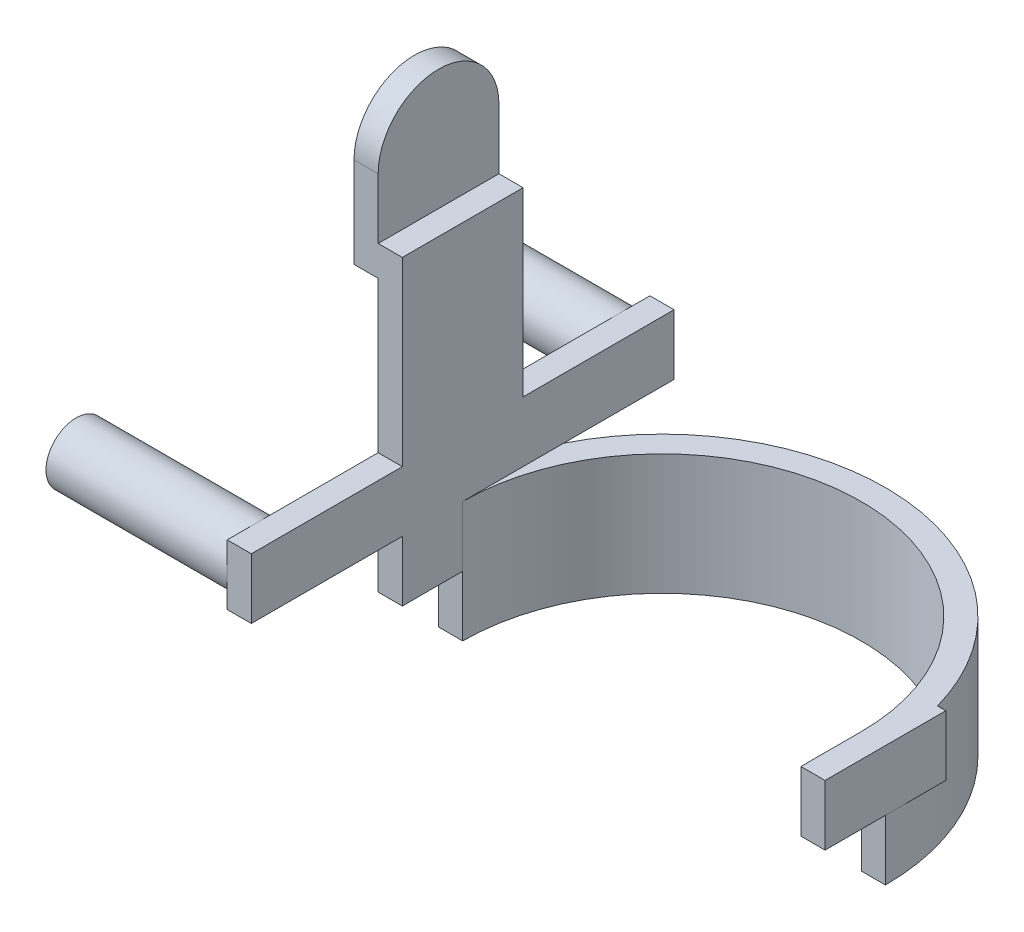
ISO-10303-21;
HEADER;
FILE_DESCRIPTION(('STEP AP214'),'2;1');
FILE_NAME('part.step','',(''),(''),'','','');
FILE_SCHEMA(('AUTOMOTIVE_DESIGN { 1 0 10303 214 1 1 1 1 }'));
ENDSEC;
DATA;
#1=APPLICATION_CONTEXT('core data for automotive mechanical design processes');
#2=APPLICATION_PROTOCOL_DEFINITION('international standard','automotive_design',2000,#1);
#3=PRODUCT_CONTEXT('',#1,'mechanical');
#4=PRODUCT('Part','Part','',(#3));
#5=PRODUCT_RELATED_PRODUCT_CATEGORY('part','',(#4));
#6=PRODUCT_DEFINITION_FORMATION('','',#4);
#7=PRODUCT_DEFINITION_CONTEXT('part definition',#1,'design');
#8=PRODUCT_DEFINITION('design','',#6,#7);
#9=PRODUCT_DEFINITION_SHAPE('','',#8);
#10=(LENGTH_UNIT() NAMED_UNIT(*) SI_UNIT(.MILLI.,.METRE.));
#11=(NAMED_UNIT(*) PLANE_ANGLE_UNIT() SI_UNIT($,.RADIAN.));
#12=(NAMED_UNIT(*) SI_UNIT($,.STERADIAN.) SOLID_ANGLE_UNIT());
#13=UNCERTAINTY_MEASURE_WITH_UNIT(LENGTH_MEASURE(1.E-05),#10,'distance_accuracy_value','');
#14=(GEOMETRIC_REPRESENTATION_CONTEXT(3) GLOBAL_UNCERTAINTY_ASSIGNED_CONTEXT((#13)) GLOBAL_UNIT_ASSIGNED_CONTEXT((#10,
#11,#12)) REPRESENTATION_CONTEXT('',''));
#15=CARTESIAN_POINT('',(0.,0.,0.));
#16=DIRECTION('',(0.,0.,1.));
#17=DIRECTION('',(1.,0.,0.));
#18=AXIS2_PLACEMENT_3D('',#15,#16,#17);
#19=CARTESIAN_POINT('',(-74.,40.,20.));
#20=DIRECTION('',(0.,0.,-1.));
#21=DIRECTION('',(-1.,0.,0.));
#22=AXIS2_PLACEMENT_3D('',#19,#20,#21);
#23=PLANE('',#22);
#24=DIRECTION('',(-1.,0.,0.));
#25=VECTOR('',#24,1.);
#26=CARTESIAN_POINT('',(-42.,140.,20.));
#27=LINE('',#26,#25);
#28=CARTESIAN_POINT('',(-74.,140.,20.));
#29=VERTEX_POINT('',#28);
#30=CARTESIAN_POINT('',(-82.,140.,20.));
#31=VERTEX_POINT('',#30);
#32=EDGE_CURVE('E226',#29,#31,#27,.T.);
#33=ORIENTED_EDGE('',*,*,#32,.T.);
#34=DIRECTION('',(0.,-1.,0.));
#35=VECTOR('',#34,1.);
#36=CARTESIAN_POINT('',(-82.,110.,20.));
#37=LINE('',#36,#35);
#38=CARTESIAN_POINT('',(-82.,110.,20.));
#39=VERTEX_POINT('',#38);
#40=EDGE_CURVE('E237',#31,#39,#37,.T.);
#41=ORIENTED_EDGE('',*,*,#40,.T.);
#42=DIRECTION('',(1.,0.,0.));
#43=VECTOR('',#42,1.);
#44=CARTESIAN_POINT('',(-74.,110.,20.));
#45=LINE('',#44,#43);
#46=CARTESIAN_POINT('',(-74.,110.,20.));
#47=VERTEX_POINT('',#46);
#48=EDGE_CURVE('E246',#39,#47,#45,.T.);
#49=ORIENTED_EDGE('',*,*,#48,.T.);
#50=DIRECTION('',(0.,-1.,0.));
#51=VECTOR('',#50,1.);
#52=CARTESIAN_POINT('',(-74.,40.,20.));
#53=LINE('',#52,#51);
#54=CARTESIAN_POINT('',(-74.,60.,20.));
#55=VERTEX_POINT('',#54);
#56=EDGE_CURVE('E417',#47,#55,#53,.T.);
#57=ORIENTED_EDGE('',*,*,#56,.T.);
#58=DIRECTION('',(1.,0.,0.));
#59=VECTOR('',#58,1.);
#60=CARTESIAN_POINT('',(-74.,60.,20.));
#61=LINE('',#60,#59);
#62=CARTESIAN_POINT('',(-66.,60.,20.));
#63=VERTEX_POINT('',#62);
#64=EDGE_CURVE('E319',#55,#63,#61,.T.);
#65=ORIENTED_EDGE('',*,*,#64,.T.);
#66=DIRECTION('',(0.,-1.,0.));
#67=VECTOR('',#66,1.);
#68=CARTESIAN_POINT('',(-66.,40.,20.));
#69=LINE('',#68,#67);
#70=CARTESIAN_POINT('',(-66.,120.,20.));
#71=VERTEX_POINT('',#70);
#72=EDGE_CURVE('E413',#71,#63,#69,.T.);
#73=ORIENTED_EDGE('',*,*,#72,.F.);
#74=DIRECTION('',(1.,0.,0.));
#75=VECTOR('',#74,1.);
#76=CARTESIAN_POINT('',(-74.,120.,20.));
#77=LINE('',#76,#75);
#78=CARTESIAN_POINT('',(-74.,120.,20.));
#79=VERTEX_POINT('',#78);
#80=EDGE_CURVE('E388',#79,#71,#77,.T.);
#81=ORIENTED_EDGE('',*,*,#80,.F.);
#82=DIRECTION('',(0.,1.,0.));
#83=VECTOR('',#82,1.);
#84=CARTESIAN_POINT('',(-74.,110.,20.));
#85=LINE('',#84,#83);
#86=EDGE_CURVE('E240',#79,#29,#85,.T.);
#87=ORIENTED_EDGE('',*,*,#86,.T.);
#88=EDGE_LOOP('',(#33,#41,#49,#57,#65,#73,#81,#87));
#89=FACE_BOUND('',#88,.T.);
#90=ADVANCED_FACE('F34',(#89),#23,.F.);
#91=CARTESIAN_POINT('',(-74.,40.,-20.));
#92=DIRECTION('',(1.,0.,0.));
#93=DIRECTION('',(0.,0.,-1.));
#94=AXIS2_PLACEMENT_3D('',#91,#92,#93);
#95=PLANE('',#94);
#96=CARTESIAN_POINT('',(-74.,50.,60.));
#97=DIRECTION('',(-1.,0.,0.));
#98=DIRECTION('',(0.,0.,1.));
#99=AXIS2_PLACEMENT_3D('',#96,#97,#98);
#100=CIRCLE('',#99,9.99999999999999);
#101=CARTESIAN_POINT('',(-74.,40.,60.));
#102=VERTEX_POINT('',#101);
#103=CARTESIAN_POINT('',(-74.,50.,70.));
#104=VERTEX_POINT('',#103);
#105=EDGE_CURVE('E256',#102,#104,#100,.T.);
#106=ORIENTED_EDGE('',*,*,#105,.F.);
#107=DIRECTION('',(0.,0.,1.));
#108=VECTOR('',#107,1.);
#109=CARTESIAN_POINT('',(-74.,40.,-70.));
#110=LINE('',#109,#108);
#111=CARTESIAN_POINT('',(-74.,40.,70.));
#112=VERTEX_POINT('',#111);
#113=EDGE_CURVE('E290',#102,#112,#110,.T.);
#114=ORIENTED_EDGE('',*,*,#113,.T.);
#115=DIRECTION('',(0.,1.,0.));
#116=VECTOR('',#115,1.);
#117=CARTESIAN_POINT('',(-74.,60.,70.));
#118=LINE('',#117,#116);
#119=EDGE_CURVE('E297',#112,#104,#118,.T.);
#120=ORIENTED_EDGE('',*,*,#119,.T.);
#121=EDGE_LOOP('',(#106,#114,#120));
#122=FACE_BOUND('',#121,.T.);
#123=ADVANCED_FACE('F542',(#122),#95,.F.);
#124=CARTESIAN_POINT('',(-74.,60.,60.));
#125=VERTEX_POINT('',#124);
#126=EDGE_CURVE('E58',#104,#125,#100,.T.);
#127=ORIENTED_EDGE('',*,*,#126,.F.);
#128=CARTESIAN_POINT('',(-74.,60.,70.));
#129=VERTEX_POINT('',#128);
#130=EDGE_CURVE('E294',#104,#129,#118,.T.);
#131=ORIENTED_EDGE('',*,*,#130,.T.);
#132=DIRECTION('',(0.,0.,-1.));
#133=VECTOR('',#132,1.);
#134=CARTESIAN_POINT('',(-74.,60.,-70.));
#135=LINE('',#134,#133);
#136=EDGE_CURVE('E276',#129,#125,#135,.T.);
#137=ORIENTED_EDGE('',*,*,#136,.T.);
#138=EDGE_LOOP('',(#127,#131,#137));
#139=FACE_BOUND('',#138,.T.);
#140=ADVANCED_FACE('F547',(#139),#95,.F.);
#141=CARTESIAN_POINT('',(-74.,50.,-60.));
#142=DIRECTION('',(-1.,0.,0.));
#143=DIRECTION('',(0.,0.,1.));
#144=AXIS2_PLACEMENT_3D('',#141,#142,#143);
#145=CIRCLE('',#144,10.);
#146=CARTESIAN_POINT('',(-74.,50.,-70.));
#147=VERTEX_POINT('',#146);
#148=CARTESIAN_POINT('',(-74.,40.,-60.));
#149=VERTEX_POINT('',#148);
#150=EDGE_CURVE('E271',#147,#149,#145,.T.);
#151=ORIENTED_EDGE('',*,*,#150,.F.);
#152=DIRECTION('',(0.,-1.,0.));
#153=VECTOR('',#152,1.);
#154=CARTESIAN_POINT('',(-74.,60.,-70.));
#155=LINE('',#154,#153);
#156=CARTESIAN_POINT('',(-74.,40.,-70.));
#157=VERTEX_POINT('',#156);
#158=EDGE_CURVE('E267',#147,#157,#155,.T.);
#159=ORIENTED_EDGE('',*,*,#158,.T.);
#160=EDGE_CURVE('E291',#157,#149,#110,.T.);
#161=ORIENTED_EDGE('',*,*,#160,.T.);
#162=EDGE_LOOP('',(#151,#159,#161));
#163=FACE_BOUND('',#162,.T.);
#164=ADVANCED_FACE('F564',(#163),#95,.F.);
#165=ORIENTED_EDGE('',*,*,#56,.F.);
#166=DIRECTION('',(0.,0.,1.));
#167=VECTOR('',#166,1.);
#168=CARTESIAN_POINT('',(-74.,110.,-20.));
#169=LINE('',#168,#167);
#170=CARTESIAN_POINT('',(-74.,110.,-20.));
#171=VERTEX_POINT('',#170);
#172=EDGE_CURVE('E254',#171,#47,#169,.T.);
#173=ORIENTED_EDGE('',*,*,#172,.F.);
#174=DIRECTION('',(0.,-1.,0.));
#175=VECTOR('',#174,1.);
#176=CARTESIAN_POINT('',(-74.,40.,-20.));
#177=LINE('',#176,#175);
#178=CARTESIAN_POINT('',(-74.,60.,-20.));
#179=VERTEX_POINT('',#178);
#180=EDGE_CURVE('E420',#171,#179,#177,.T.);
#181=ORIENTED_EDGE('',*,*,#180,.T.);
#182=CARTESIAN_POINT('',(-74.,60.,-60.));
#183=VERTEX_POINT('',#182);
#184=EDGE_CURVE('E303',#179,#183,#135,.T.);
#185=ORIENTED_EDGE('',*,*,#184,.T.);
#186=EDGE_CURVE('E262',#149,#183,#145,.T.);
#187=ORIENTED_EDGE('',*,*,#186,.F.);
#188=CARTESIAN_POINT('',(-74.,40.,-20.));
#189=VERTEX_POINT('',#188);
#190=EDGE_CURVE('E295',#149,#189,#110,.T.);
#191=ORIENTED_EDGE('',*,*,#190,.T.);
#192=CARTESIAN_POINT('',(-74.,20.,-20.));
#193=VERTEX_POINT('',#192);
#194=EDGE_CURVE('E419',#189,#193,#177,.T.);
#195=ORIENTED_EDGE('',*,*,#194,.T.);
#196=DIRECTION('',(0.,0.,-1.));
#197=VECTOR('',#196,1.);
#198=CARTESIAN_POINT('',(-74.,20.,-20.));
#199=LINE('',#198,#197);
#200=CARTESIAN_POINT('',(-74.,20.,0.));
#201=VERTEX_POINT('',#200);
#202=EDGE_CURVE('E366',#201,#193,#199,.T.);
#203=ORIENTED_EDGE('',*,*,#202,.F.);
#204=CARTESIAN_POINT('',(-74.,20.,20.));
#205=VERTEX_POINT('',#204);
#206=EDGE_CURVE('E356',#205,#201,#199,.T.);
#207=ORIENTED_EDGE('',*,*,#206,.F.);
#208=CARTESIAN_POINT('',(-74.,40.,20.));
#209=VERTEX_POINT('',#208);
#210=EDGE_CURVE('E416',#209,#205,#53,.T.);
#211=ORIENTED_EDGE('',*,*,#210,.F.);
#212=EDGE_CURVE('E296',#209,#102,#110,.T.);
#213=ORIENTED_EDGE('',*,*,#212,.T.);
#214=EDGE_CURVE('E50',#125,#102,#100,.T.);
#215=ORIENTED_EDGE('',*,*,#214,.F.);
#216=EDGE_CURVE('E302',#125,#55,#135,.T.);
#217=ORIENTED_EDGE('',*,*,#216,.T.);
#218=EDGE_LOOP('',(#165,#173,#181,#185,#187,#191,#195,#203,#207,#211,#213,#215,#217));
#219=FACE_BOUND('',#218,.T.);
#220=ADVANCED_FACE('F466',(#219),#95,.F.);
#221=CARTESIAN_POINT('',(-74.,40.,-20.));
#222=DIRECTION('',(0.,0.,1.));
#223=DIRECTION('',(1.,0.,0.));
#224=AXIS2_PLACEMENT_3D('',#221,#222,#223);
#225=PLANE('',#224);
#226=DIRECTION('',(0.,-1.,0.));
#227=VECTOR('',#226,1.);
#228=CARTESIAN_POINT('',(-82.,110.,-20.));
#229=LINE('',#228,#227);
#230=CARTESIAN_POINT('',(-82.,140.,-20.));
#231=VERTEX_POINT('',#230);
#232=CARTESIAN_POINT('',(-82.,110.,-20.));
#233=VERTEX_POINT('',#232);
#234=EDGE_CURVE('E586',#231,#233,#229,.T.);
#235=ORIENTED_EDGE('',*,*,#234,.F.);
#236=DIRECTION('',(-1.,0.,0.));
#237=VECTOR('',#236,1.);
#238=CARTESIAN_POINT('',(-42.,140.,-20.));
#239=LINE('',#238,#237);
#240=CARTESIAN_POINT('',(-74.,140.,-20.));
#241=VERTEX_POINT('',#240);
#242=EDGE_CURVE('E229',#241,#231,#239,.T.);
#243=ORIENTED_EDGE('',*,*,#242,.F.);
#244=DIRECTION('',(0.,1.,0.));
#245=VECTOR('',#244,1.);
#246=CARTESIAN_POINT('',(-74.,110.,-20.));
#247=LINE('',#246,#245);
#248=CARTESIAN_POINT('',(-74.,120.,-20.));
#249=VERTEX_POINT('',#248);
#250=EDGE_CURVE('E248',#249,#241,#247,.T.);
#251=ORIENTED_EDGE('',*,*,#250,.F.);
#252=DIRECTION('',(-1.,0.,0.));
#253=VECTOR('',#252,1.);
#254=CARTESIAN_POINT('',(-74.,120.,-20.));
#255=LINE('',#254,#253);
#256=CARTESIAN_POINT('',(-66.,120.,-20.));
#257=VERTEX_POINT('',#256);
#258=EDGE_CURVE('E393',#257,#249,#255,.T.);
#259=ORIENTED_EDGE('',*,*,#258,.F.);
#260=DIRECTION('',(0.,-1.,0.));
#261=VECTOR('',#260,1.);
#262=CARTESIAN_POINT('',(-66.,120.,-20.));
#263=LINE('',#262,#261);
#264=CARTESIAN_POINT('',(-66.,60.,-20.));
#265=VERTEX_POINT('',#264);
#266=EDGE_CURVE('E395',#257,#265,#263,.T.);
#267=ORIENTED_EDGE('',*,*,#266,.T.);
#268=DIRECTION('',(-1.,0.,0.));
#269=VECTOR('',#268,1.);
#270=CARTESIAN_POINT('',(-74.,60.,-20.));
#271=LINE('',#270,#269);
#272=EDGE_CURVE('E323',#265,#179,#271,.T.);
#273=ORIENTED_EDGE('',*,*,#272,.T.);
#274=ORIENTED_EDGE('',*,*,#180,.F.);
#275=DIRECTION('',(1.,0.,0.));
#276=VECTOR('',#275,1.);
#277=CARTESIAN_POINT('',(-74.,110.,-20.));
#278=LINE('',#277,#276);
#279=EDGE_CURVE('E258',#233,#171,#278,.T.);
#280=ORIENTED_EDGE('',*,*,#279,.F.);
#281=EDGE_LOOP('',(#235,#243,#251,#259,#267,#273,#274,#280));
#282=FACE_BOUND('',#281,.T.);
#283=ADVANCED_FACE('F505',(#282),#225,.F.);
#284=CARTESIAN_POINT('',(0.,40.,0.));
#285=DIRECTION('',(0.,1.,0.));
#286=DIRECTION('',(0.,0.,1.));
#287=AXIS2_PLACEMENT_3D('',#284,#285,#286);
#288=PLANE('',#287);
#289=CARTESIAN_POINT('',(0.,40.,0.));
#290=DIRECTION('',(0.,1.,0.));
#291=DIRECTION('',(0.,0.,1.));
#292=AXIS2_PLACEMENT_3D('',#289,#290,#291);
#293=CIRCLE('',#292,74.);
#294=CARTESIAN_POINT('',(71.2460525222275,40.,-20.));
#295=VERTEX_POINT('',#294);
#296=CARTESIAN_POINT('',(-66.,40.,-33.466401061363));
#297=VERTEX_POINT('',#296);
#298=EDGE_CURVE('E403',#295,#297,#293,.T.);
#299=ORIENTED_EDGE('',*,*,#298,.T.);
#300=DIRECTION('',(0.,0.,-1.));
#301=VECTOR('',#300,1.);
#302=CARTESIAN_POINT('',(-66.,40.,20.));
#303=LINE('',#302,#301);
#304=CARTESIAN_POINT('',(-66.,40.,0.));
#305=VERTEX_POINT('',#304);
#306=EDGE_CURVE('E11',#305,#297,#303,.T.);
#307=ORIENTED_EDGE('',*,*,#306,.F.);
#308=CARTESIAN_POINT('',(0.,40.,0.));
#309=DIRECTION('',(0.,-1.,0.));
#310=DIRECTION('',(0.,0.,1.));
#311=AXIS2_PLACEMENT_3D('',#308,#309,#310);
#312=CIRCLE('',#311,66.);
#313=CARTESIAN_POINT('',(66.,40.,0.));
#314=VERTEX_POINT('',#313);
#315=EDGE_CURVE('E399',#305,#314,#312,.T.);
#316=ORIENTED_EDGE('',*,*,#315,.T.);
#317=DIRECTION('',(0.,0.,-1.));
#318=VECTOR('',#317,1.);
#319=CARTESIAN_POINT('',(66.,40.,0.));
#320=LINE('',#319,#318);
#321=CARTESIAN_POINT('',(66.,40.,20.));
#322=VERTEX_POINT('',#321);
#323=EDGE_CURVE('E382',#322,#314,#320,.T.);
#324=ORIENTED_EDGE('',*,*,#323,.F.);
#325=DIRECTION('',(-1.,0.,0.));
#326=VECTOR('',#325,1.);
#327=CARTESIAN_POINT('',(74.,40.,20.));
#328=LINE('',#327,#326);
#329=CARTESIAN_POINT('',(74.,40.,20.));
#330=VERTEX_POINT('',#329);
#331=EDGE_CURVE('E379',#330,#322,#328,.T.);
#332=ORIENTED_EDGE('',*,*,#331,.F.);
#333=DIRECTION('',(0.,0.,-1.));
#334=VECTOR('',#333,1.);
#335=CARTESIAN_POINT('',(74.,40.,-20.));
#336=LINE('',#335,#334);
#337=CARTESIAN_POINT('',(74.,40.,-20.));
#338=VERTEX_POINT('',#337);
#339=EDGE_CURVE('E374',#330,#338,#336,.T.);
#340=ORIENTED_EDGE('',*,*,#339,.T.);
#341=DIRECTION('',(1.,0.,0.));
#342=VECTOR('',#341,1.);
#343=CARTESIAN_POINT('',(64.,40.,-20.));
#344=LINE('',#343,#342);
#345=EDGE_CURVE('E376',#295,#338,#344,.T.);
#346=ORIENTED_EDGE('',*,*,#345,.F.);
#347=EDGE_LOOP('',(#299,#307,#316,#324,#332,#340,#346));
#348=FACE_BOUND('',#347,.T.);
#349=ADVANCED_FACE('F480',(#348),#288,.T.);
#350=CARTESIAN_POINT('',(66.,40.,0.));
#351=DIRECTION('',(1.,0.,0.));
#352=DIRECTION('',(0.,0.,-1.));
#353=AXIS2_PLACEMENT_3D('',#350,#351,#352);
#354=PLANE('',#353);
#355=DIRECTION('',(0.,0.,1.));
#356=VECTOR('',#355,1.);
#357=CARTESIAN_POINT('',(66.,20.,20.));
#358=LINE('',#357,#356);
#359=CARTESIAN_POINT('',(66.,20.,0.));
#360=VERTEX_POINT('',#359);
#361=CARTESIAN_POINT('',(66.,20.,20.));
#362=VERTEX_POINT('',#361);
#363=EDGE_CURVE('E344',#360,#362,#358,.T.);
#364=ORIENTED_EDGE('',*,*,#363,.T.);
#365=DIRECTION('',(0.,-1.,0.));
#366=VECTOR('',#365,1.);
#367=CARTESIAN_POINT('',(66.,40.,20.));
#368=LINE('',#367,#366);
#369=EDGE_CURVE('E433',#322,#362,#368,.T.);
#370=ORIENTED_EDGE('',*,*,#369,.F.);
#371=ORIENTED_EDGE('',*,*,#323,.T.);
#372=DIRECTION('',(0.,-1.,0.));
#373=VECTOR('',#372,1.);
#374=CARTESIAN_POINT('',(66.,40.,0.));
#375=LINE('',#374,#373);
#376=EDGE_CURVE('E38',#314,#360,#375,.T.);
#377=ORIENTED_EDGE('',*,*,#376,.T.);
#378=EDGE_LOOP('',(#364,#370,#371,#377));
#379=FACE_BOUND('',#378,.T.);
#380=ADVANCED_FACE('F440',(#379),#354,.F.);
#381=CARTESIAN_POINT('',(74.,40.,20.));
#382=DIRECTION('',(0.,0.,-1.));
#383=DIRECTION('',(-1.,0.,0.));
#384=AXIS2_PLACEMENT_3D('',#381,#382,#383);
#385=PLANE('',#384);
#386=DIRECTION('',(1.,0.,0.));
#387=VECTOR('',#386,1.);
#388=CARTESIAN_POINT('',(71.2460525222275,20.,20.));
#389=LINE('',#388,#387);
#390=CARTESIAN_POINT('',(74.,20.,20.));
#391=VERTEX_POINT('',#390);
#392=EDGE_CURVE('E347',#362,#391,#389,.T.);
#393=ORIENTED_EDGE('',*,*,#392,.T.);
#394=DIRECTION('',(0.,-1.,0.));
#395=VECTOR('',#394,1.);
#396=CARTESIAN_POINT('',(74.,40.,20.));
#397=LINE('',#396,#395);
#398=EDGE_CURVE('E431',#330,#391,#397,.T.);
#399=ORIENTED_EDGE('',*,*,#398,.F.);
#400=ORIENTED_EDGE('',*,*,#331,.T.);
#401=ORIENTED_EDGE('',*,*,#369,.T.);
#402=EDGE_LOOP('',(#393,#399,#400,#401));
#403=FACE_BOUND('',#402,.T.);
#404=ADVANCED_FACE('F641',(#403),#385,.F.);
#405=CARTESIAN_POINT('',(74.,40.,-20.));
#406=DIRECTION('',(-1.,0.,0.));
#407=DIRECTION('',(0.,0.,1.));
#408=AXIS2_PLACEMENT_3D('',#405,#406,#407);
#409=PLANE('',#408);
#410=DIRECTION('',(0.,0.,1.));
#411=VECTOR('',#410,1.);
#412=CARTESIAN_POINT('',(74.,20.,-20.));
#413=LINE('',#412,#411);
#414=CARTESIAN_POINT('',(74.,20.,-20.));
#415=VERTEX_POINT('',#414);
#416=CARTESIAN_POINT('',(74.,20.,0.));
#417=VERTEX_POINT('',#416);
#418=EDGE_CURVE('E371',#415,#417,#413,.T.);
#419=ORIENTED_EDGE('',*,*,#418,.F.);
#420=DIRECTION('',(0.,-1.,0.));
#421=VECTOR('',#420,1.);
#422=CARTESIAN_POINT('',(74.,40.,-20.));
#423=LINE('',#422,#421);
#424=EDGE_CURVE('E428',#338,#415,#423,.T.);
#425=ORIENTED_EDGE('',*,*,#424,.F.);
#426=ORIENTED_EDGE('',*,*,#339,.F.);
#427=ORIENTED_EDGE('',*,*,#398,.T.);
#428=EDGE_CURVE('E373',#417,#391,#413,.T.);
#429=ORIENTED_EDGE('',*,*,#428,.F.);
#430=EDGE_LOOP('',(#419,#425,#426,#427,#429));
#431=FACE_BOUND('',#430,.T.);
#432=ADVANCED_FACE('F638',(#431),#409,.F.);
#433=CARTESIAN_POINT('',(74.,40.,-20.));
#434=DIRECTION('',(0.,0.,1.));
#435=DIRECTION('',(1.,0.,0.));
#436=AXIS2_PLACEMENT_3D('',#433,#434,#435);
#437=PLANE('',#436);
#438=DIRECTION('',(1.,0.,0.));
#439=VECTOR('',#438,1.);
#440=CARTESIAN_POINT('',(74.,20.,-20.));
#441=LINE('',#440,#439);
#442=CARTESIAN_POINT('',(71.2460525222275,20.,-20.));
#443=VERTEX_POINT('',#442);
#444=EDGE_CURVE('E369',#443,#415,#441,.T.);
#445=ORIENTED_EDGE('',*,*,#444,.F.);
#446=DIRECTION('',(0.,-1.,0.));
#447=VECTOR('',#446,1.);
#448=CARTESIAN_POINT('',(71.2460525222275,40.,-20.));
#449=LINE('',#448,#447);
#450=EDGE_CURVE('E425',#295,#443,#449,.T.);
#451=ORIENTED_EDGE('',*,*,#450,.F.);
#452=ORIENTED_EDGE('',*,*,#345,.T.);
#453=ORIENTED_EDGE('',*,*,#424,.T.);
#454=EDGE_LOOP('',(#445,#451,#452,#453));
#455=FACE_BOUND('',#454,.T.);
#456=ADVANCED_FACE('F561',(#455),#437,.F.);
#457=ORIENTED_EDGE('',*,*,#194,.F.);
#458=DIRECTION('',(1.,0.,0.));
#459=VECTOR('',#458,1.);
#460=CARTESIAN_POINT('',(-74.,40.,-20.));
#461=LINE('',#460,#459);
#462=CARTESIAN_POINT('',(-71.2460525222275,40.,-20.));
#463=VERTEX_POINT('',#462);
#464=EDGE_CURVE('E316',#189,#463,#461,.T.);
#465=ORIENTED_EDGE('',*,*,#464,.T.);
#466=DIRECTION('',(0.,-1.,0.));
#467=VECTOR('',#466,1.);
#468=CARTESIAN_POINT('',(-71.2460525222275,40.,-20.));
#469=LINE('',#468,#467);
#470=CARTESIAN_POINT('',(-71.2460525222275,20.,-20.));
#471=VERTEX_POINT('',#470);
#472=EDGE_CURVE('E422',#463,#471,#469,.T.);
#473=ORIENTED_EDGE('',*,*,#472,.T.);
#474=DIRECTION('',(1.,0.,0.));
#475=VECTOR('',#474,1.);
#476=CARTESIAN_POINT('',(-74.,20.,-20.));
#477=LINE('',#476,#475);
#478=EDGE_CURVE('E367',#193,#471,#477,.T.);
#479=ORIENTED_EDGE('',*,*,#478,.F.);
#480=EDGE_LOOP('',(#457,#465,#473,#479));
#481=FACE_BOUND('',#480,.T.);
#482=ADVANCED_FACE('F472',(#481),#225,.F.);
#483=EDGE_CURVE('E268',#183,#147,#145,.T.);
#484=ORIENTED_EDGE('',*,*,#483,.F.);
#485=CARTESIAN_POINT('',(-74.,60.,-70.));
#486=VERTEX_POINT('',#485);
#487=EDGE_CURVE('E300',#183,#486,#135,.T.);
#488=ORIENTED_EDGE('',*,*,#487,.T.);
#489=EDGE_CURVE('E288',#486,#147,#155,.T.);
#490=ORIENTED_EDGE('',*,*,#489,.T.);
#491=EDGE_LOOP('',(#484,#488,#490));
#492=FACE_BOUND('',#491,.T.);
#493=ADVANCED_FACE('F550',(#492),#95,.F.);
#494=CARTESIAN_POINT('',(-66.,40.,20.));
#495=VERTEX_POINT('',#494);
#496=CARTESIAN_POINT('',(-66.,20.,20.));
#497=VERTEX_POINT('',#496);
#498=EDGE_CURVE('E412',#495,#497,#69,.T.);
#499=ORIENTED_EDGE('',*,*,#498,.F.);
#500=DIRECTION('',(-1.,0.,0.));
#501=VECTOR('',#500,1.);
#502=CARTESIAN_POINT('',(-74.,40.,20.));
#503=LINE('',#502,#501);
#504=EDGE_CURVE('E307',#495,#209,#503,.T.);
#505=ORIENTED_EDGE('',*,*,#504,.T.);
#506=ORIENTED_EDGE('',*,*,#210,.T.);
#507=DIRECTION('',(1.,0.,0.));
#508=VECTOR('',#507,1.);
#509=CARTESIAN_POINT('',(-71.2460525222275,20.,20.));
#510=LINE('',#509,#508);
#511=EDGE_CURVE('E327',#205,#497,#510,.T.);
#512=ORIENTED_EDGE('',*,*,#511,.T.);
#513=EDGE_LOOP('',(#499,#505,#506,#512));
#514=FACE_BOUND('',#513,.T.);
#515=ADVANCED_FACE('F526',(#514),#23,.F.);
#516=CARTESIAN_POINT('',(-66.,40.,0.));
#517=DIRECTION('',(-1.,0.,0.));
#518=DIRECTION('',(0.,0.,1.));
#519=AXIS2_PLACEMENT_3D('',#516,#517,#518);
#520=PLANE('',#519);
#521=DIRECTION('',(0.,-1.,0.));
#522=VECTOR('',#521,1.);
#523=CARTESIAN_POINT('',(-66.,40.,0.));
#524=LINE('',#523,#522);
#525=CARTESIAN_POINT('',(-66.,20.,0.));
#526=VERTEX_POINT('',#525);
#527=EDGE_CURVE('E406',#305,#526,#524,.T.);
#528=ORIENTED_EDGE('',*,*,#527,.F.);
#529=ORIENTED_EDGE('',*,*,#306,.T.);
#530=DIRECTION('',(0.,0.,1.));
#531=VECTOR('',#530,1.);
#532=CARTESIAN_POINT('',(-66.,40.,-70.));
#533=LINE('',#532,#531);
#534=CARTESIAN_POINT('',(-66.,40.,-70.));
#535=VERTEX_POINT('',#534);
#536=EDGE_CURVE('E277',#535,#297,#533,.T.);
#537=ORIENTED_EDGE('',*,*,#536,.F.);
#538=DIRECTION('',(0.,-1.,0.));
#539=VECTOR('',#538,1.);
#540=CARTESIAN_POINT('',(-66.,60.,-70.));
#541=LINE('',#540,#539);
#542=CARTESIAN_POINT('',(-66.,60.,-70.));
#543=VERTEX_POINT('',#542);
#544=EDGE_CURVE('E272',#543,#535,#541,.T.);
#545=ORIENTED_EDGE('',*,*,#544,.F.);
#546=DIRECTION('',(0.,0.,-1.));
#547=VECTOR('',#546,1.);
#548=CARTESIAN_POINT('',(-66.,60.,-70.));
#549=LINE('',#548,#547);
#550=EDGE_CURVE('E283',#265,#543,#549,.T.);
#551=ORIENTED_EDGE('',*,*,#550,.F.);
#552=ORIENTED_EDGE('',*,*,#266,.F.);
#553=DIRECTION('',(0.,0.,-1.));
#554=VECTOR('',#553,1.);
#555=CARTESIAN_POINT('',(-66.,120.,20.));
#556=LINE('',#555,#554);
#557=EDGE_CURVE('E391',#71,#257,#556,.T.);
#558=ORIENTED_EDGE('',*,*,#557,.F.);
#559=ORIENTED_EDGE('',*,*,#72,.T.);
#560=CARTESIAN_POINT('',(-66.,60.,70.));
#561=VERTEX_POINT('',#560);
#562=EDGE_CURVE('E284',#561,#63,#549,.T.);
#563=ORIENTED_EDGE('',*,*,#562,.F.);
#564=DIRECTION('',(0.,1.,0.));
#565=VECTOR('',#564,1.);
#566=CARTESIAN_POINT('',(-66.,60.,70.));
#567=LINE('',#566,#565);
#568=CARTESIAN_POINT('',(-66.,40.,70.));
#569=VERTEX_POINT('',#568);
#570=EDGE_CURVE('E280',#569,#561,#567,.T.);
#571=ORIENTED_EDGE('',*,*,#570,.F.);
#572=EDGE_CURVE('E275',#495,#569,#533,.T.);
#573=ORIENTED_EDGE('',*,*,#572,.F.);
#574=ORIENTED_EDGE('',*,*,#498,.T.);
#575=DIRECTION('',(0.,0.,-1.));
#576=VECTOR('',#575,1.);
#577=CARTESIAN_POINT('',(-66.,20.,20.));
#578=LINE('',#577,#576);
#579=EDGE_CURVE('E330',#497,#526,#578,.T.);
#580=ORIENTED_EDGE('',*,*,#579,.T.);
#581=EDGE_LOOP('',(#528,#529,#537,#545,#551,#552,#558,#559,#563,#571,#573,#574,#580));
#582=FACE_BOUND('',#581,.T.);
#583=ADVANCED_FACE('F487',(#582),#520,.F.);
#584=CARTESIAN_POINT('',(0.,0.,0.));
#585=DIRECTION('',(0.,1.,0.));
#586=DIRECTION('',(0.,0.,1.));
#587=AXIS2_PLACEMENT_3D('',#584,#585,#586);
#588=PLANE('',#587);
#589=DIRECTION('',(-1.,0.,0.));
#590=VECTOR('',#589,1.);
#591=CARTESIAN_POINT('',(74.,0.,0.));
#592=LINE('',#591,#590);
#593=CARTESIAN_POINT('',(74.,0.,0.));
#594=VERTEX_POINT('',#593);
#595=CARTESIAN_POINT('',(66.,0.,0.));
#596=VERTEX_POINT('',#595);
#597=EDGE_CURVE('E331',#594,#596,#592,.T.);
#598=ORIENTED_EDGE('',*,*,#597,.T.);
#599=CARTESIAN_POINT('',(0.,0.,0.));
#600=DIRECTION('',(0.,-1.,0.));
#601=DIRECTION('',(0.,0.,1.));
#602=AXIS2_PLACEMENT_3D('',#599,#600,#601);
#603=CIRCLE('',#602,66.);
#604=CARTESIAN_POINT('',(-66.,0.,0.));
#605=VERTEX_POINT('',#604);
#606=EDGE_CURVE('E398',#605,#596,#603,.T.);
#607=ORIENTED_EDGE('',*,*,#606,.F.);
#608=DIRECTION('',(-1.,0.,0.));
#609=VECTOR('',#608,1.);
#610=CARTESIAN_POINT('',(-74.,0.,0.));
#611=LINE('',#610,#609);
#612=CARTESIAN_POINT('',(-74.,0.,0.));
#613=VERTEX_POINT('',#612);
#614=EDGE_CURVE('E326',#605,#613,#611,.T.);
#615=ORIENTED_EDGE('',*,*,#614,.T.);
#616=CARTESIAN_POINT('',(0.,0.,0.));
#617=DIRECTION('',(0.,1.,0.));
#618=DIRECTION('',(0.,0.,1.));
#619=AXIS2_PLACEMENT_3D('',#616,#617,#618);
#620=CIRCLE('',#619,74.);
#621=EDGE_CURVE('E402',#594,#613,#620,.T.);
#622=ORIENTED_EDGE('',*,*,#621,.F.);
#623=EDGE_LOOP('',(#598,#607,#615,#622));
#624=FACE_BOUND('',#623,.T.);
#625=ADVANCED_FACE('F451',(#624),#588,.F.);
#626=CARTESIAN_POINT('',(0.,40.,0.));
#627=DIRECTION('',(0.,-1.,0.));
#628=DIRECTION('',(0.,0.,-1.));
#629=AXIS2_PLACEMENT_3D('',#626,#627,#628);
#630=CYLINDRICAL_SURFACE('',#629,66.);
#631=ORIENTED_EDGE('',*,*,#606,.T.);
#632=DIRECTION('',(0.,-1.,0.));
#633=VECTOR('',#632,1.);
#634=CARTESIAN_POINT('',(66.,20.,0.));
#635=LINE('',#634,#633);
#636=EDGE_CURVE('E354',#360,#596,#635,.T.);
#637=ORIENTED_EDGE('',*,*,#636,.F.);
#638=ORIENTED_EDGE('',*,*,#376,.F.);
#639=ORIENTED_EDGE('',*,*,#315,.F.);
#640=ORIENTED_EDGE('',*,*,#527,.T.);
#641=DIRECTION('',(0.,-1.,0.));
#642=VECTOR('',#641,1.);
#643=CARTESIAN_POINT('',(-66.,20.,0.));
#644=LINE('',#643,#642);
#645=EDGE_CURVE('E349',#526,#605,#644,.T.);
#646=ORIENTED_EDGE('',*,*,#645,.T.);
#647=EDGE_LOOP('',(#631,#637,#638,#639,#640,#646));
#648=FACE_BOUND('',#647,.T.);
#649=ADVANCED_FACE('F36',(#648),#630,.F.);
#650=CARTESIAN_POINT('',(0.,40.,0.));
#651=DIRECTION('',(0.,-1.,0.));
#652=DIRECTION('',(0.,0.,-1.));
#653=AXIS2_PLACEMENT_3D('',#650,#651,#652);
#654=CYLINDRICAL_SURFACE('',#653,74.);
#655=ORIENTED_EDGE('',*,*,#621,.T.);
#656=DIRECTION('',(0.,-1.,0.));
#657=VECTOR('',#656,1.);
#658=CARTESIAN_POINT('',(-74.,20.,0.));
#659=LINE('',#658,#657);
#660=EDGE_CURVE('E360',#201,#613,#659,.T.);
#661=ORIENTED_EDGE('',*,*,#660,.F.);
#662=CARTESIAN_POINT('',(0.,20.,0.));
#663=DIRECTION('',(0.,-1.,0.));
#664=DIRECTION('',(0.,0.,-1.));
#665=AXIS2_PLACEMENT_3D('',#662,#663,#664);
#666=CIRCLE('',#665,74.);
#667=EDGE_CURVE('E338',#201,#471,#666,.T.);
#668=ORIENTED_EDGE('',*,*,#667,.T.);
#669=ORIENTED_EDGE('',*,*,#472,.F.);
#670=EDGE_CURVE('E401',#297,#463,#293,.T.);
#671=ORIENTED_EDGE('',*,*,#670,.F.);
#672=ORIENTED_EDGE('',*,*,#298,.F.);
#673=ORIENTED_EDGE('',*,*,#450,.T.);
#674=EDGE_CURVE('E337',#443,#417,#666,.T.);
#675=ORIENTED_EDGE('',*,*,#674,.T.);
#676=DIRECTION('',(0.,-1.,0.));
#677=VECTOR('',#676,1.);
#678=CARTESIAN_POINT('',(74.,20.,0.));
#679=LINE('',#678,#677);
#680=EDGE_CURVE('E357',#417,#594,#679,.T.);
#681=ORIENTED_EDGE('',*,*,#680,.T.);
#682=EDGE_LOOP('',(#655,#661,#668,#669,#671,#672,#673,#675,#681));
#683=FACE_BOUND('',#682,.T.);
#684=ADVANCED_FACE('F454',(#683),#654,.T.);
#685=CARTESIAN_POINT('',(0.,120.,0.));
#686=DIRECTION('',(0.,-1.,0.));
#687=DIRECTION('',(0.,0.,-1.));
#688=AXIS2_PLACEMENT_3D('',#685,#686,#687);
#689=PLANE('',#688);
#690=DIRECTION('',(0.,0.,1.));
#691=VECTOR('',#690,1.);
#692=CARTESIAN_POINT('',(-74.,120.,20.));
#693=LINE('',#692,#691);
#694=EDGE_CURVE('E385',#249,#79,#693,.T.);
#695=ORIENTED_EDGE('',*,*,#694,.T.);
#696=ORIENTED_EDGE('',*,*,#80,.T.);
#697=ORIENTED_EDGE('',*,*,#557,.T.);
#698=ORIENTED_EDGE('',*,*,#258,.T.);
#699=EDGE_LOOP('',(#695,#696,#697,#698));
#700=FACE_BOUND('',#699,.T.);
#701=ADVANCED_FACE('F508',(#700),#689,.F.);
#702=CARTESIAN_POINT('',(-74.,20.,0.));
#703=DIRECTION('',(0.,0.,1.));
#704=DIRECTION('',(1.,0.,0.));
#705=AXIS2_PLACEMENT_3D('',#702,#703,#704);
#706=PLANE('',#705);
#707=ORIENTED_EDGE('',*,*,#614,.F.);
#708=ORIENTED_EDGE('',*,*,#645,.F.);
#709=DIRECTION('',(-1.,0.,0.));
#710=VECTOR('',#709,1.);
#711=CARTESIAN_POINT('',(-74.,20.,0.));
#712=LINE('',#711,#710);
#713=EDGE_CURVE('E334',#526,#201,#712,.T.);
#714=ORIENTED_EDGE('',*,*,#713,.T.);
#715=ORIENTED_EDGE('',*,*,#660,.T.);
#716=EDGE_LOOP('',(#707,#708,#714,#715));
#717=FACE_BOUND('',#716,.T.);
#718=ADVANCED_FACE('F458',(#717),#706,.T.);
#719=CARTESIAN_POINT('',(0.,20.,0.));
#720=DIRECTION('',(0.,-1.,0.));
#721=DIRECTION('',(0.,0.,-1.));
#722=AXIS2_PLACEMENT_3D('',#719,#720,#721);
#723=PLANE('',#722);
#724=ORIENTED_EDGE('',*,*,#206,.T.);
#725=ORIENTED_EDGE('',*,*,#713,.F.);
#726=ORIENTED_EDGE('',*,*,#579,.F.);
#727=ORIENTED_EDGE('',*,*,#511,.F.);
#728=EDGE_LOOP('',(#724,#725,#726,#727));
#729=FACE_BOUND('',#728,.T.);
#730=ADVANCED_FACE('F528',(#729),#723,.T.);
#731=ORIENTED_EDGE('',*,*,#478,.T.);
#732=ORIENTED_EDGE('',*,*,#667,.F.);
#733=ORIENTED_EDGE('',*,*,#202,.T.);
#734=EDGE_LOOP('',(#731,#732,#733));
#735=FACE_BOUND('',#734,.T.);
#736=ADVANCED_FACE('F470',(#735),#723,.T.);
#737=ORIENTED_EDGE('',*,*,#428,.T.);
#738=ORIENTED_EDGE('',*,*,#392,.F.);
#739=ORIENTED_EDGE('',*,*,#363,.F.);
#740=DIRECTION('',(-1.,0.,0.));
#741=VECTOR('',#740,1.);
#742=CARTESIAN_POINT('',(74.,20.,0.));
#743=LINE('',#742,#741);
#744=EDGE_CURVE('E341',#417,#360,#743,.T.);
#745=ORIENTED_EDGE('',*,*,#744,.F.);
#746=EDGE_LOOP('',(#737,#738,#739,#745));
#747=FACE_BOUND('',#746,.T.);
#748=ADVANCED_FACE('F531',(#747),#723,.T.);
#749=ORIENTED_EDGE('',*,*,#418,.T.);
#750=ORIENTED_EDGE('',*,*,#674,.F.);
#751=ORIENTED_EDGE('',*,*,#444,.T.);
#752=EDGE_LOOP('',(#749,#750,#751));
#753=FACE_BOUND('',#752,.T.);
#754=ADVANCED_FACE('F536',(#753),#723,.T.);
#755=CARTESIAN_POINT('',(74.,20.,0.));
#756=DIRECTION('',(0.,0.,1.));
#757=DIRECTION('',(1.,0.,0.));
#758=AXIS2_PLACEMENT_3D('',#755,#756,#757);
#759=PLANE('',#758);
#760=ORIENTED_EDGE('',*,*,#597,.F.);
#761=ORIENTED_EDGE('',*,*,#680,.F.);
#762=ORIENTED_EDGE('',*,*,#744,.T.);
#763=ORIENTED_EDGE('',*,*,#636,.T.);
#764=EDGE_LOOP('',(#760,#761,#762,#763));
#765=FACE_BOUND('',#764,.T.);
#766=ADVANCED_FACE('F447',(#765),#759,.T.);
#767=CARTESIAN_POINT('',(-66.,60.,-70.));
#768=DIRECTION('',(0.,0.,-1.));
#769=DIRECTION('',(-1.,0.,0.));
#770=AXIS2_PLACEMENT_3D('',#767,#768,#769);
#771=PLANE('',#770);
#772=ORIENTED_EDGE('',*,*,#489,.F.);
#773=DIRECTION('',(-1.,0.,0.));
#774=VECTOR('',#773,1.);
#775=CARTESIAN_POINT('',(-66.,60.,-70.));
#776=LINE('',#775,#774);
#777=EDGE_CURVE('E304',#543,#486,#776,.T.);
#778=ORIENTED_EDGE('',*,*,#777,.F.);
#779=ORIENTED_EDGE('',*,*,#544,.T.);
#780=DIRECTION('',(-1.,0.,0.));
#781=VECTOR('',#780,1.);
#782=CARTESIAN_POINT('',(-66.,40.,-70.));
#783=LINE('',#782,#781);
#784=EDGE_CURVE('E287',#535,#157,#783,.T.);
#785=ORIENTED_EDGE('',*,*,#784,.T.);
#786=ORIENTED_EDGE('',*,*,#158,.F.);
#787=EDGE_LOOP('',(#772,#778,#779,#785,#786));
#788=FACE_BOUND('',#787,.T.);
#789=ADVANCED_FACE('F492',(#788),#771,.T.);
#790=CARTESIAN_POINT('',(-66.,40.,-70.));
#791=DIRECTION('',(0.,-1.,0.));
#792=DIRECTION('',(0.,0.,-1.));
#793=AXIS2_PLACEMENT_3D('',#790,#791,#792);
#794=PLANE('',#793);
#795=ORIENTED_EDGE('',*,*,#464,.F.);
#796=ORIENTED_EDGE('',*,*,#190,.F.);
#797=ORIENTED_EDGE('',*,*,#160,.F.);
#798=ORIENTED_EDGE('',*,*,#784,.F.);
#799=ORIENTED_EDGE('',*,*,#536,.T.);
#800=ORIENTED_EDGE('',*,*,#670,.T.);
#801=EDGE_LOOP('',(#795,#796,#797,#798,#799,#800));
#802=FACE_BOUND('',#801,.T.);
#803=ADVANCED_FACE('F483',(#802),#794,.T.);
#804=CARTESIAN_POINT('',(-66.,60.,-70.));
#805=DIRECTION('',(0.,1.,0.));
#806=DIRECTION('',(0.,0.,1.));
#807=AXIS2_PLACEMENT_3D('',#804,#805,#806);
#808=PLANE('',#807);
#809=ORIENTED_EDGE('',*,*,#272,.F.);
#810=ORIENTED_EDGE('',*,*,#550,.T.);
#811=ORIENTED_EDGE('',*,*,#777,.T.);
#812=ORIENTED_EDGE('',*,*,#487,.F.);
#813=ORIENTED_EDGE('',*,*,#184,.F.);
#814=EDGE_LOOP('',(#809,#810,#811,#812,#813));
#815=FACE_BOUND('',#814,.T.);
#816=ADVANCED_FACE('F497',(#815),#808,.T.);
#817=ORIENTED_EDGE('',*,*,#64,.F.);
#818=ORIENTED_EDGE('',*,*,#216,.F.);
#819=ORIENTED_EDGE('',*,*,#136,.F.);
#820=DIRECTION('',(-1.,0.,0.));
#821=VECTOR('',#820,1.);
#822=CARTESIAN_POINT('',(-66.,60.,70.));
#823=LINE('',#822,#821);
#824=EDGE_CURVE('E308',#561,#129,#823,.T.);
#825=ORIENTED_EDGE('',*,*,#824,.F.);
#826=ORIENTED_EDGE('',*,*,#562,.T.);
#827=EDGE_LOOP('',(#817,#818,#819,#825,#826));
#828=FACE_BOUND('',#827,.T.);
#829=ADVANCED_FACE('F513',(#828),#808,.T.);
#830=ORIENTED_EDGE('',*,*,#504,.F.);
#831=ORIENTED_EDGE('',*,*,#572,.T.);
#832=DIRECTION('',(-1.,0.,0.));
#833=VECTOR('',#832,1.);
#834=CARTESIAN_POINT('',(-66.,40.,70.));
#835=LINE('',#834,#833);
#836=EDGE_CURVE('E311',#569,#112,#835,.T.);
#837=ORIENTED_EDGE('',*,*,#836,.T.);
#838=ORIENTED_EDGE('',*,*,#113,.F.);
#839=ORIENTED_EDGE('',*,*,#212,.F.);
#840=EDGE_LOOP('',(#830,#831,#837,#838,#839));
#841=FACE_BOUND('',#840,.T.);
#842=ADVANCED_FACE('F522',(#841),#794,.T.);
#843=CARTESIAN_POINT('',(-66.,60.,70.));
#844=DIRECTION('',(0.,0.,1.));
#845=DIRECTION('',(0.,-1.,0.));
#846=AXIS2_PLACEMENT_3D('',#843,#844,#845);
#847=PLANE('',#846);
#848=ORIENTED_EDGE('',*,*,#119,.F.);
#849=ORIENTED_EDGE('',*,*,#836,.F.);
#850=ORIENTED_EDGE('',*,*,#570,.T.);
#851=ORIENTED_EDGE('',*,*,#824,.T.);
#852=ORIENTED_EDGE('',*,*,#130,.F.);
#853=EDGE_LOOP('',(#848,#849,#850,#851,#852));
#854=FACE_BOUND('',#853,.T.);
#855=ADVANCED_FACE('F518',(#854),#847,.T.);
#856=CARTESIAN_POINT('',(-134.,50.,-60.));
#857=DIRECTION('',(1.,0.,0.));
#858=DIRECTION('',(0.,0.,-1.));
#859=AXIS2_PLACEMENT_3D('',#856,#857,#858);
#860=CYLINDRICAL_SURFACE('',#859,10.);
#861=CARTESIAN_POINT('',(-134.,50.,-60.));
#862=DIRECTION('',(-1.,0.,0.));
#863=DIRECTION('',(0.,0.,1.));
#864=AXIS2_PLACEMENT_3D('',#861,#862,#863);
#865=CIRCLE('',#864,10.);
#866=CARTESIAN_POINT('',(-134.,50.,-50.));
#867=VERTEX_POINT('',#866);
#868=EDGE_CURVE('E264',#867,#867,#865,.T.);
#869=ORIENTED_EDGE('',*,*,#868,.F.);
#870=EDGE_LOOP('',(#869));
#871=FACE_BOUND('',#870,.T.);
#872=ORIENTED_EDGE('',*,*,#483,.T.);
#873=ORIENTED_EDGE('',*,*,#150,.T.);
#874=ORIENTED_EDGE('',*,*,#186,.T.);
#875=EDGE_LOOP('',(#872,#873,#874));
#876=FACE_BOUND('',#875,.T.);
#877=ADVANCED_FACE('F577',(#871,#876),#860,.T.);
#878=CARTESIAN_POINT('',(-134.,50.,-60.));
#879=DIRECTION('',(-1.,0.,0.));
#880=DIRECTION('',(0.,0.,1.));
#881=AXIS2_PLACEMENT_3D('',#878,#879,#880);
#882=PLANE('',#881);
#883=ORIENTED_EDGE('',*,*,#868,.T.);
#884=EDGE_LOOP('',(#883));
#885=FACE_BOUND('',#884,.T.);
#886=ADVANCED_FACE('F609',(#885),#882,.T.);
#887=CARTESIAN_POINT('',(-134.,50.,60.));
#888=DIRECTION('',(1.,0.,0.));
#889=DIRECTION('',(0.,0.,-1.));
#890=AXIS2_PLACEMENT_3D('',#887,#888,#889);
#891=CYLINDRICAL_SURFACE('',#890,9.99999999999999);
#892=CARTESIAN_POINT('',(-134.,50.,60.));
#893=DIRECTION('',(-1.,0.,0.));
#894=DIRECTION('',(0.,0.,1.));
#895=AXIS2_PLACEMENT_3D('',#892,#893,#894);
#896=CIRCLE('',#895,9.99999999999999);
#897=CARTESIAN_POINT('',(-134.,50.,70.));
#898=VERTEX_POINT('',#897);
#899=EDGE_CURVE('E259',#898,#898,#896,.T.);
#900=ORIENTED_EDGE('',*,*,#899,.F.);
#901=EDGE_LOOP('',(#900));
#902=FACE_BOUND('',#901,.T.);
#903=ORIENTED_EDGE('',*,*,#126,.T.);
#904=ORIENTED_EDGE('',*,*,#214,.T.);
#905=ORIENTED_EDGE('',*,*,#105,.T.);
#906=EDGE_LOOP('',(#903,#904,#905));
#907=FACE_BOUND('',#906,.T.);
#908=ADVANCED_FACE('F581',(#902,#907),#891,.T.);
#909=CARTESIAN_POINT('',(-134.,50.,60.));
#910=DIRECTION('',(-1.,0.,0.));
#911=DIRECTION('',(0.,0.,1.));
#912=AXIS2_PLACEMENT_3D('',#909,#910,#911);
#913=PLANE('',#912);
#914=ORIENTED_EDGE('',*,*,#899,.T.);
#915=EDGE_LOOP('',(#914));
#916=FACE_BOUND('',#915,.T.);
#917=ADVANCED_FACE('F596',(#916),#913,.T.);
#918=CARTESIAN_POINT('',(-74.,110.,-20.));
#919=DIRECTION('',(1.,0.,0.));
#920=DIRECTION('',(0.,0.,-1.));
#921=AXIS2_PLACEMENT_3D('',#918,#919,#920);
#922=PLANE('',#921);
#923=CARTESIAN_POINT('',(-74.,140.,0.));
#924=DIRECTION('',(1.,0.,0.));
#925=DIRECTION('',(0.,0.,-1.));
#926=AXIS2_PLACEMENT_3D('',#923,#924,#925);
#927=CIRCLE('',#926,20.);
#928=EDGE_CURVE('E250',#29,#241,#927,.F.);
#929=ORIENTED_EDGE('',*,*,#928,.F.);
#930=ORIENTED_EDGE('',*,*,#86,.F.);
#931=ORIENTED_EDGE('',*,*,#694,.F.);
#932=ORIENTED_EDGE('',*,*,#250,.T.);
#933=EDGE_LOOP('',(#929,#930,#931,#932));
#934=FACE_BOUND('',#933,.T.);
#935=ADVANCED_FACE('F593',(#934),#922,.T.);
#936=CARTESIAN_POINT('',(-74.,110.,-20.));
#937=DIRECTION('',(0.,-1.,0.));
#938=DIRECTION('',(0.,0.,-1.));
#939=AXIS2_PLACEMENT_3D('',#936,#937,#938);
#940=PLANE('',#939);
#941=ORIENTED_EDGE('',*,*,#48,.F.);
#942=DIRECTION('',(0.,0.,1.));
#943=VECTOR('',#942,1.);
#944=CARTESIAN_POINT('',(-82.,110.,-20.));
#945=LINE('',#944,#943);
#946=EDGE_CURVE('E244',#233,#39,#945,.T.);
#947=ORIENTED_EDGE('',*,*,#946,.F.);
#948=ORIENTED_EDGE('',*,*,#279,.T.);
#949=ORIENTED_EDGE('',*,*,#172,.T.);
#950=EDGE_LOOP('',(#941,#947,#948,#949));
#951=FACE_BOUND('',#950,.T.);
#952=ADVANCED_FACE('F595',(#951),#940,.T.);
#953=CARTESIAN_POINT('',(-82.,110.,-20.));
#954=DIRECTION('',(-1.,0.,0.));
#955=DIRECTION('',(0.,-1.,0.));
#956=AXIS2_PLACEMENT_3D('',#953,#954,#955);
#957=PLANE('',#956);
#958=CARTESIAN_POINT('',(-82.,140.,0.));
#959=DIRECTION('',(1.,0.,0.));
#960=DIRECTION('',(0.,-1.,0.));
#961=AXIS2_PLACEMENT_3D('',#958,#959,#960);
#962=CIRCLE('',#961,20.);
#963=EDGE_CURVE('E223',#231,#31,#962,.T.);
#964=ORIENTED_EDGE('',*,*,#963,.F.);
#965=ORIENTED_EDGE('',*,*,#234,.T.);
#966=ORIENTED_EDGE('',*,*,#946,.T.);
#967=ORIENTED_EDGE('',*,*,#40,.F.);
#968=EDGE_LOOP('',(#964,#965,#966,#967));
#969=FACE_BOUND('',#968,.T.);
#970=ADVANCED_FACE('F242',(#969),#957,.T.);
#971=CARTESIAN_POINT('',(-42.,140.,0.));
#972=DIRECTION('',(-1.,0.,0.));
#973=DIRECTION('',(0.,-1.,0.));
#974=AXIS2_PLACEMENT_3D('',#971,#972,#973);
#975=CYLINDRICAL_SURFACE('',#974,20.);
#976=ORIENTED_EDGE('',*,*,#928,.T.);
#977=ORIENTED_EDGE('',*,*,#242,.T.);
#978=ORIENTED_EDGE('',*,*,#963,.T.);
#979=ORIENTED_EDGE('',*,*,#32,.F.);
#980=EDGE_LOOP('',(#976,#977,#978,#979));
#981=FACE_BOUND('',#980,.T.);
#982=ADVANCED_FACE('F225',(#981),#975,.T.);
#983=CLOSED_SHELL('',(#90,#123,#140,#164,#220,#283,#349,#380,#404,#432,#456,#482,#493,#515,#583,
#625,#649,#684,#701,#718,#730,#736,#748,#754,#766,#789,#803,#816,#829,#842,#855,#877,#886,#908,
#917,#935,#952,#970,#982));
#984=MANIFOLD_SOLID_BREP('B2',#983);
#985=ADVANCED_BREP_SHAPE_REPRESENTATION('',(#18,#984),#14);
#986=SHAPE_DEFINITION_REPRESENTATION(#9,#985);
ENDSEC;
END-ISO-10303-21;
